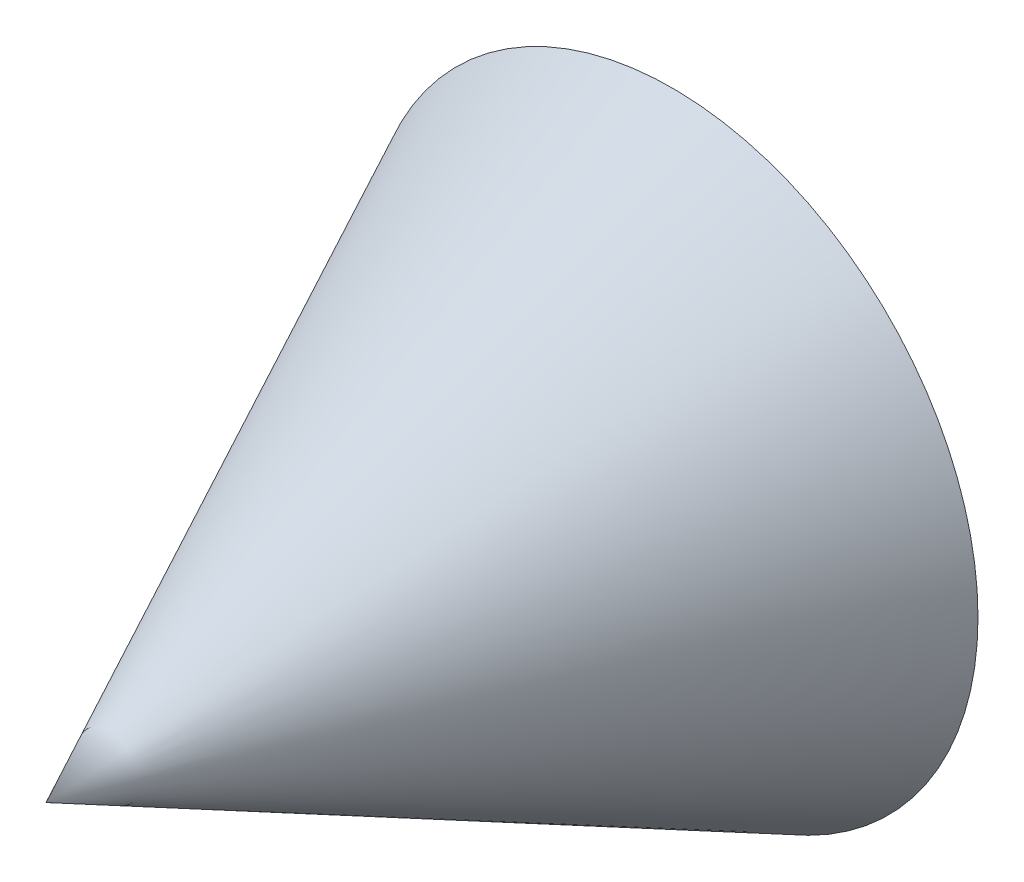
ISO-10303-21;
HEADER;
FILE_DESCRIPTION(('STEP AP214'),'2;1');
FILE_NAME('part.step','',(''),(''),'','','');
FILE_SCHEMA(('AUTOMOTIVE_DESIGN { 1 0 10303 214 1 1 1 1 }'));
ENDSEC;
DATA;
#1=APPLICATION_CONTEXT('core data for automotive mechanical design processes');
#2=APPLICATION_PROTOCOL_DEFINITION('international standard','automotive_design',2000,#1);
#3=PRODUCT_CONTEXT('',#1,'mechanical');
#4=PRODUCT('Part','Part','',(#3));
#5=PRODUCT_RELATED_PRODUCT_CATEGORY('part','',(#4));
#6=PRODUCT_DEFINITION_FORMATION('','',#4);
#7=PRODUCT_DEFINITION_CONTEXT('part definition',#1,'design');
#8=PRODUCT_DEFINITION('design','',#6,#7);
#9=PRODUCT_DEFINITION_SHAPE('','',#8);
#10=(LENGTH_UNIT() NAMED_UNIT(*) SI_UNIT(.MILLI.,.METRE.));
#11=(NAMED_UNIT(*) PLANE_ANGLE_UNIT() SI_UNIT($,.RADIAN.));
#12=(NAMED_UNIT(*) SI_UNIT($,.STERADIAN.) SOLID_ANGLE_UNIT());
#13=UNCERTAINTY_MEASURE_WITH_UNIT(LENGTH_MEASURE(1.E-05),#10,'distance_accuracy_value','');
#14=(GEOMETRIC_REPRESENTATION_CONTEXT(3) GLOBAL_UNCERTAINTY_ASSIGNED_CONTEXT((#13)) GLOBAL_UNIT_ASSIGNED_CONTEXT((#10,
#11,#12)) REPRESENTATION_CONTEXT('',''));
#15=CARTESIAN_POINT('',(0.,0.,0.));
#16=DIRECTION('',(0.,0.,1.));
#17=DIRECTION('',(1.,0.,0.));
#18=AXIS2_PLACEMENT_3D('',#15,#16,#17);
#19=CARTESIAN_POINT('',(0.,0.,0.));
#20=DIRECTION('',(0.,0.,-1.));
#21=DIRECTION('',(1.,0.,0.));
#22=AXIS2_PLACEMENT_3D('',#19,#20,#21);
#23=CONICAL_SURFACE('',#22,40.,0.453785605518526);
#24=CARTESIAN_POINT('',(0.,0.,82.0121536631718));
#25=VERTEX_POINT('',#24);
#26=VERTEX_LOOP('',#25);
#27=FACE_BOUND('',#26,.T.);
#28=CARTESIAN_POINT('',(0.,0.,0.));
#29=DIRECTION('',(0.,0.,1.));
#30=DIRECTION('',(1.,0.,0.));
#31=AXIS2_PLACEMENT_3D('',#28,#29,#30);
#32=CIRCLE('',#31,40.);
#33=CARTESIAN_POINT('',(40.,0.,0.));
#34=VERTEX_POINT('',#33);
#35=EDGE_CURVE('E11',#34,#34,#32,.T.);
#36=ORIENTED_EDGE('',*,*,#35,.T.);
#37=EDGE_LOOP('',(#36));
#38=FACE_BOUND('',#37,.T.);
#39=ADVANCED_FACE('F33',(#27,#38),#23,.T.);
#40=CARTESIAN_POINT('',(0.,0.,0.));
#41=DIRECTION('',(0.,0.,1.));
#42=DIRECTION('',(1.,0.,0.));
#43=AXIS2_PLACEMENT_3D('',#40,#41,#42);
#44=PLANE('',#43);
#45=CARTESIAN_POINT('',(0.,0.,0.));
#46=DIRECTION('',(0.,0.,-1.));
#47=DIRECTION('',(-1.,0.,0.));
#48=AXIS2_PLACEMENT_3D('',#45,#46,#47);
#49=CIRCLE('',#48,30.);
#50=CARTESIAN_POINT('',(-30.,0.,0.));
#51=VERTEX_POINT('',#50);
#52=EDGE_CURVE('E40',#51,#51,#49,.T.);
#53=ORIENTED_EDGE('',*,*,#52,.F.);
#54=EDGE_LOOP('',(#53));
#55=FACE_BOUND('',#54,.T.);
#56=ORIENTED_EDGE('',*,*,#35,.F.);
#57=EDGE_LOOP('',(#56));
#58=FACE_BOUND('',#57,.T.);
#59=ADVANCED_FACE('F49',(#55,#58),#44,.F.);
#60=CARTESIAN_POINT('',(0.,0.,0.));
#61=DIRECTION('',(0.,0.,-1.));
#62=DIRECTION('',(-1.,0.,0.));
#63=AXIS2_PLACEMENT_3D('',#60,#61,#62);
#64=CONICAL_SURFACE('',#63,30.,0.523598775598299);
#65=CARTESIAN_POINT('',(0.,0.,51.9615242270663));
#66=VERTEX_POINT('',#65);
#67=VERTEX_LOOP('',#66);
#68=FACE_BOUND('',#67,.T.);
#69=ORIENTED_EDGE('',*,*,#52,.T.);
#70=EDGE_LOOP('',(#69));
#71=FACE_BOUND('',#70,.T.);
#72=ADVANCED_FACE('F46',(#68,#71),#64,.F.);
#73=CLOSED_SHELL('',(#39,#59,#72));
#74=MANIFOLD_SOLID_BREP('B2',#73);
#75=ADVANCED_BREP_SHAPE_REPRESENTATION('',(#18,#74),#14);
#76=SHAPE_DEFINITION_REPRESENTATION(#9,#75);
ENDSEC;
END-ISO-10303-21;
